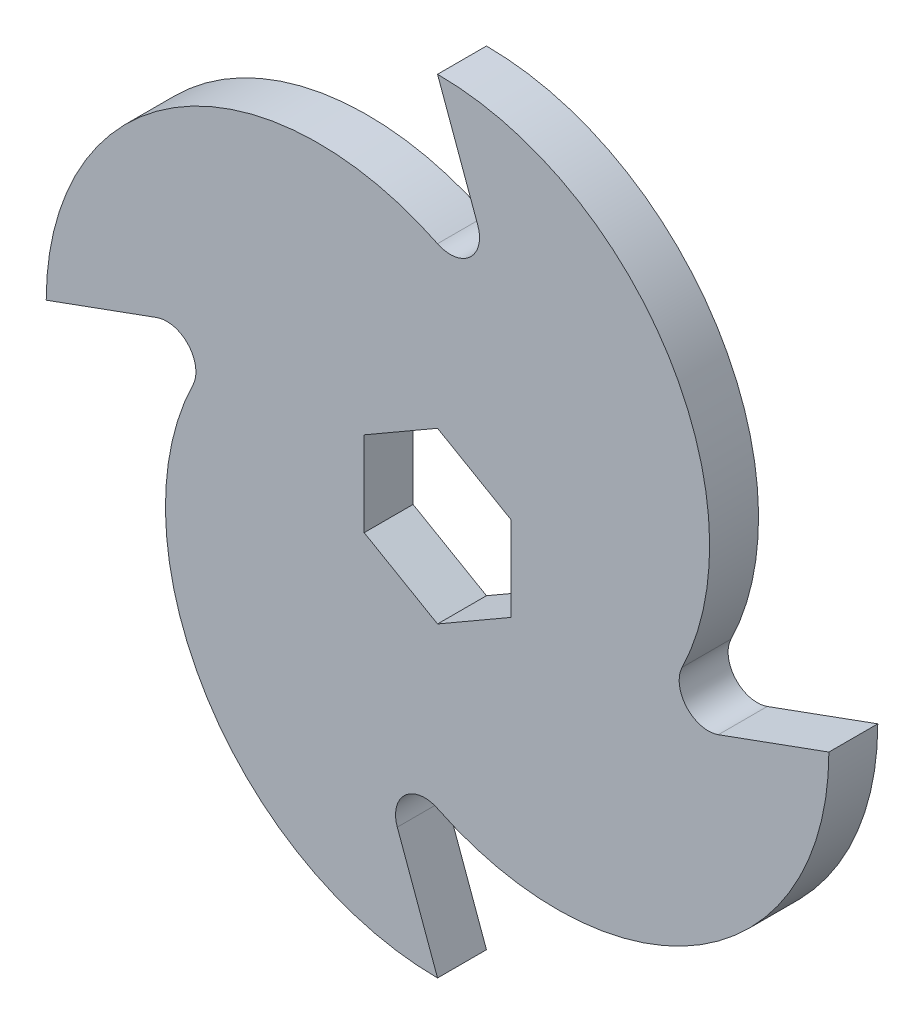
ISO-10303-21;
HEADER;
FILE_DESCRIPTION(('STEP AP214'),'2;1');
FILE_NAME('part.step','',(''),(''),'','','');
FILE_SCHEMA(('AUTOMOTIVE_DESIGN { 1 0 10303 214 1 1 1 1 }'));
ENDSEC;
DATA;
#1=APPLICATION_CONTEXT('core data for automotive mechanical design processes');
#2=APPLICATION_PROTOCOL_DEFINITION('international standard','automotive_design',2000,#1);
#3=PRODUCT_CONTEXT('',#1,'mechanical');
#4=PRODUCT('Part','Part','',(#3));
#5=PRODUCT_RELATED_PRODUCT_CATEGORY('part','',(#4));
#6=PRODUCT_DEFINITION_FORMATION('','',#4);
#7=PRODUCT_DEFINITION_CONTEXT('part definition',#1,'design');
#8=PRODUCT_DEFINITION('design','',#6,#7);
#9=PRODUCT_DEFINITION_SHAPE('','',#8);
#10=(LENGTH_UNIT() NAMED_UNIT(*) SI_UNIT(.MILLI.,.METRE.));
#11=(NAMED_UNIT(*) PLANE_ANGLE_UNIT() SI_UNIT($,.RADIAN.));
#12=(NAMED_UNIT(*) SI_UNIT($,.STERADIAN.) SOLID_ANGLE_UNIT());
#13=UNCERTAINTY_MEASURE_WITH_UNIT(LENGTH_MEASURE(1.E-05),#10,'distance_accuracy_value','');
#14=(GEOMETRIC_REPRESENTATION_CONTEXT(3) GLOBAL_UNCERTAINTY_ASSIGNED_CONTEXT((#13)) GLOBAL_UNIT_ASSIGNED_CONTEXT((#10,
#11,#12)) REPRESENTATION_CONTEXT('',''));
#15=CARTESIAN_POINT('',(0.,0.,0.));
#16=DIRECTION('',(0.,0.,1.));
#17=DIRECTION('',(1.,0.,0.));
#18=AXIS2_PLACEMENT_3D('',#15,#16,#17);
#19=CARTESIAN_POINT('',(4.76249999999999,8.24889197104678,3.175));
#20=DIRECTION('',(-0.5,-0.866025403784439,0.));
#21=DIRECTION('',(0.866025403784439,-0.5,0.));
#22=AXIS2_PLACEMENT_3D('',#19,#20,#21);
#23=PLANE('',#22);
#24=DIRECTION('',(-0.866025403784439,0.5,0.));
#25=VECTOR('',#24,1.);
#26=CARTESIAN_POINT('',(4.76249999999999,8.24889197104678,-3.175));
#27=LINE('',#26,#25);
#28=CARTESIAN_POINT('',(9.525,5.49926131403119,-3.175));
#29=VERTEX_POINT('',#28);
#30=CARTESIAN_POINT('',(0.,10.9985226280624,-3.175));
#31=VERTEX_POINT('',#30);
#32=EDGE_CURVE('E224',#29,#31,#27,.T.);
#33=ORIENTED_EDGE('',*,*,#32,.F.);
#34=DIRECTION('',(0.,0.,-1.));
#35=VECTOR('',#34,1.);
#36=CARTESIAN_POINT('',(9.525,5.49926131403119,3.175));
#37=LINE('',#36,#35);
#38=CARTESIAN_POINT('',(9.525,5.49926131403119,3.175));
#39=VERTEX_POINT('',#38);
#40=EDGE_CURVE('E11',#39,#29,#37,.T.);
#41=ORIENTED_EDGE('',*,*,#40,.F.);
#42=DIRECTION('',(-0.866025403784439,0.5,0.));
#43=VECTOR('',#42,1.);
#44=CARTESIAN_POINT('',(4.76249999999999,8.24889197104678,3.175));
#45=LINE('',#44,#43);
#46=CARTESIAN_POINT('',(0.,10.9985226280624,3.175));
#47=VERTEX_POINT('',#46);
#48=EDGE_CURVE('E319',#39,#47,#45,.T.);
#49=ORIENTED_EDGE('',*,*,#48,.T.);
#50=DIRECTION('',(0.,0.,-1.));
#51=VECTOR('',#50,1.);
#52=CARTESIAN_POINT('',(0.,10.9985226280624,3.175));
#53=LINE('',#52,#51);
#54=EDGE_CURVE('E56',#47,#31,#53,.T.);
#55=ORIENTED_EDGE('',*,*,#54,.T.);
#56=EDGE_LOOP('',(#33,#41,#49,#55));
#57=FACE_BOUND('',#56,.T.);
#58=ADVANCED_FACE('F37',(#57),#23,.T.);
#59=CARTESIAN_POINT('',(9.525,0.,3.175));
#60=DIRECTION('',(-1.,0.,0.));
#61=DIRECTION('',(0.,-1.,0.));
#62=AXIS2_PLACEMENT_3D('',#59,#60,#61);
#63=PLANE('',#62);
#64=DIRECTION('',(0.,1.,0.));
#65=VECTOR('',#64,1.);
#66=CARTESIAN_POINT('',(9.525,0.,-3.175));
#67=LINE('',#66,#65);
#68=CARTESIAN_POINT('',(9.525,-5.49926131403119,-3.175));
#69=VERTEX_POINT('',#68);
#70=EDGE_CURVE('E226',#69,#29,#67,.T.);
#71=ORIENTED_EDGE('',*,*,#70,.F.);
#72=DIRECTION('',(0.,0.,-1.));
#73=VECTOR('',#72,1.);
#74=CARTESIAN_POINT('',(9.525,-5.49926131403119,3.175));
#75=LINE('',#74,#73);
#76=CARTESIAN_POINT('',(9.525,-5.49926131403119,3.175));
#77=VERTEX_POINT('',#76);
#78=EDGE_CURVE('E47',#77,#69,#75,.T.);
#79=ORIENTED_EDGE('',*,*,#78,.F.);
#80=DIRECTION('',(0.,1.,0.));
#81=VECTOR('',#80,1.);
#82=CARTESIAN_POINT('',(9.525,0.,3.175));
#83=LINE('',#82,#81);
#84=EDGE_CURVE('E321',#77,#39,#83,.T.);
#85=ORIENTED_EDGE('',*,*,#84,.T.);
#86=ORIENTED_EDGE('',*,*,#40,.T.);
#87=EDGE_LOOP('',(#71,#79,#85,#86));
#88=FACE_BOUND('',#87,.T.);
#89=ADVANCED_FACE('F342',(#88),#63,.T.);
#90=CARTESIAN_POINT('',(4.7625,-8.24889197104678,3.175));
#91=DIRECTION('',(-0.5,0.866025403784439,0.));
#92=DIRECTION('',(-0.866025403784439,-0.5,0.));
#93=AXIS2_PLACEMENT_3D('',#90,#91,#92);
#94=PLANE('',#93);
#95=DIRECTION('',(0.866025403784439,0.5,0.));
#96=VECTOR('',#95,1.);
#97=CARTESIAN_POINT('',(4.7625,-8.24889197104678,-3.175));
#98=LINE('',#97,#96);
#99=CARTESIAN_POINT('',(0.,-10.9985226280624,-3.175));
#100=VERTEX_POINT('',#99);
#101=EDGE_CURVE('E229',#100,#69,#98,.T.);
#102=ORIENTED_EDGE('',*,*,#101,.F.);
#103=DIRECTION('',(0.,0.,-1.));
#104=VECTOR('',#103,1.);
#105=CARTESIAN_POINT('',(0.,-10.9985226280624,3.175));
#106=LINE('',#105,#104);
#107=CARTESIAN_POINT('',(0.,-10.9985226280624,3.175));
#108=VERTEX_POINT('',#107);
#109=EDGE_CURVE('E179',#108,#100,#106,.T.);
#110=ORIENTED_EDGE('',*,*,#109,.F.);
#111=DIRECTION('',(0.866025403784439,0.5,0.));
#112=VECTOR('',#111,1.);
#113=CARTESIAN_POINT('',(4.7625,-8.24889197104678,3.175));
#114=LINE('',#113,#112);
#115=EDGE_CURVE('E190',#108,#77,#114,.T.);
#116=ORIENTED_EDGE('',*,*,#115,.T.);
#117=ORIENTED_EDGE('',*,*,#78,.T.);
#118=EDGE_LOOP('',(#102,#110,#116,#117));
#119=FACE_BOUND('',#118,.T.);
#120=ADVANCED_FACE('F325',(#119),#94,.T.);
#121=CARTESIAN_POINT('',(-4.7625,-8.24889197104678,3.175));
#122=DIRECTION('',(0.5,0.866025403784439,0.));
#123=DIRECTION('',(-0.866025403784439,0.5,0.));
#124=AXIS2_PLACEMENT_3D('',#121,#122,#123);
#125=PLANE('',#124);
#126=DIRECTION('',(0.866025403784439,-0.5,0.));
#127=VECTOR('',#126,1.);
#128=CARTESIAN_POINT('',(-4.7625,-8.24889197104678,-3.175));
#129=LINE('',#128,#127);
#130=CARTESIAN_POINT('',(-9.525,-5.49926131403119,-3.175));
#131=VERTEX_POINT('',#130);
#132=EDGE_CURVE('E175',#131,#100,#129,.T.);
#133=ORIENTED_EDGE('',*,*,#132,.F.);
#134=DIRECTION('',(0.,0.,-1.));
#135=VECTOR('',#134,1.);
#136=CARTESIAN_POINT('',(-9.525,-5.49926131403119,3.175));
#137=LINE('',#136,#135);
#138=CARTESIAN_POINT('',(-9.525,-5.49926131403119,3.175));
#139=VERTEX_POINT('',#138);
#140=EDGE_CURVE('E170',#139,#131,#137,.T.);
#141=ORIENTED_EDGE('',*,*,#140,.F.);
#142=DIRECTION('',(0.866025403784439,-0.5,0.));
#143=VECTOR('',#142,1.);
#144=CARTESIAN_POINT('',(-4.7625,-8.24889197104678,3.175));
#145=LINE('',#144,#143);
#146=EDGE_CURVE('E173',#139,#108,#145,.T.);
#147=ORIENTED_EDGE('',*,*,#146,.T.);
#148=ORIENTED_EDGE('',*,*,#109,.T.);
#149=EDGE_LOOP('',(#133,#141,#147,#148));
#150=FACE_BOUND('',#149,.T.);
#151=ADVANCED_FACE('F172',(#150),#125,.T.);
#152=CARTESIAN_POINT('',(-9.525,0.,3.175));
#153=DIRECTION('',(1.,0.,0.));
#154=DIRECTION('',(0.,0.,-1.));
#155=AXIS2_PLACEMENT_3D('',#152,#153,#154);
#156=PLANE('',#155);
#157=DIRECTION('',(0.,-1.,0.));
#158=VECTOR('',#157,1.);
#159=CARTESIAN_POINT('',(-9.525,0.,-3.175));
#160=LINE('',#159,#158);
#161=CARTESIAN_POINT('',(-9.525,5.4992613140312,-3.175));
#162=VERTEX_POINT('',#161);
#163=EDGE_CURVE('E233',#162,#131,#160,.T.);
#164=ORIENTED_EDGE('',*,*,#163,.F.);
#165=DIRECTION('',(0.,0.,-1.));
#166=VECTOR('',#165,1.);
#167=CARTESIAN_POINT('',(-9.525,5.4992613140312,3.175));
#168=LINE('',#167,#166);
#169=CARTESIAN_POINT('',(-9.525,5.4992613140312,3.175));
#170=VERTEX_POINT('',#169);
#171=EDGE_CURVE('E111',#170,#162,#168,.T.);
#172=ORIENTED_EDGE('',*,*,#171,.F.);
#173=DIRECTION('',(0.,-1.,0.));
#174=VECTOR('',#173,1.);
#175=CARTESIAN_POINT('',(-9.525,0.,3.175));
#176=LINE('',#175,#174);
#177=EDGE_CURVE('E187',#170,#139,#176,.T.);
#178=ORIENTED_EDGE('',*,*,#177,.T.);
#179=ORIENTED_EDGE('',*,*,#140,.T.);
#180=EDGE_LOOP('',(#164,#172,#178,#179));
#181=FACE_BOUND('',#180,.T.);
#182=ADVANCED_FACE('F192',(#181),#156,.T.);
#183=CARTESIAN_POINT('',(-35.1565746055924,1.66070512022627,3.175));
#184=DIRECTION('',(0.,0.,-1.));
#185=DIRECTION('',(-1.,0.,0.));
#186=AXIS2_PLACEMENT_3D('',#183,#184,#185);
#187=CYLINDRICAL_SURFACE('',#186,3.78981424872157);
#188=CARTESIAN_POINT('',(-35.1565746055924,1.66070512022627,-3.175));
#189=DIRECTION('',(0.,0.,1.));
#190=DIRECTION('',(1.,0.,0.));
#191=AXIS2_PLACEMENT_3D('',#188,#189,#190);
#192=CIRCLE('',#191,3.78981424872157);
#193=CARTESIAN_POINT('',(-36.4527674181178,5.22196560389923,-3.175));
#194=VERTEX_POINT('',#193);
#195=CARTESIAN_POINT('',(-31.75,0.,-3.175));
#196=VERTEX_POINT('',#195);
#197=EDGE_CURVE('E199',#194,#196,#192,.F.);
#198=ORIENTED_EDGE('',*,*,#197,.T.);
#199=DIRECTION('',(0.,0.,-1.));
#200=VECTOR('',#199,1.);
#201=CARTESIAN_POINT('',(-31.75,0.,3.175));
#202=LINE('',#201,#200);
#203=CARTESIAN_POINT('',(-31.75,0.,3.175));
#204=VERTEX_POINT('',#203);
#205=EDGE_CURVE('E41',#204,#196,#202,.T.);
#206=ORIENTED_EDGE('',*,*,#205,.F.);
#207=CARTESIAN_POINT('',(-35.1565746055924,1.66070512022627,3.175));
#208=DIRECTION('',(0.,0.,1.));
#209=DIRECTION('',(1.,0.,0.));
#210=AXIS2_PLACEMENT_3D('',#207,#208,#209);
#211=CIRCLE('',#210,3.78981424872157);
#212=CARTESIAN_POINT('',(-36.4527674181178,5.22196560389923,3.175));
#213=VERTEX_POINT('',#212);
#214=EDGE_CURVE('E238',#213,#204,#211,.F.);
#215=ORIENTED_EDGE('',*,*,#214,.F.);
#216=DIRECTION('',(0.,0.,-1.));
#217=VECTOR('',#216,1.);
#218=CARTESIAN_POINT('',(-36.4527674181178,5.22196560389923,3.175));
#219=LINE('',#218,#217);
#220=EDGE_CURVE('E195',#213,#194,#219,.T.);
#221=ORIENTED_EDGE('',*,*,#220,.T.);
#222=EDGE_LOOP('',(#198,#206,#215,#221));
#223=FACE_BOUND('',#222,.T.);
#224=ADVANCED_FACE('F39',(#223),#187,.F.);
#225=CARTESIAN_POINT('',(0.,-15.478125,3.175));
#226=DIRECTION('',(0.,0.,-1.));
#227=DIRECTION('',(-1.,0.,0.));
#228=AXIS2_PLACEMENT_3D('',#225,#226,#227);
#229=CYLINDRICAL_SURFACE('',#228,35.321875);
#230=CARTESIAN_POINT('',(0.,-15.478125,-3.175));
#231=DIRECTION('',(0.,0.,1.));
#232=DIRECTION('',(1.,0.,0.));
#233=AXIS2_PLACEMENT_3D('',#230,#231,#232);
#234=CIRCLE('',#233,35.321875);
#235=CARTESIAN_POINT('',(-3.53883589099269E-13,-50.8,-3.175));
#236=VERTEX_POINT('',#235);
#237=EDGE_CURVE('E202',#196,#236,#234,.T.);
#238=ORIENTED_EDGE('',*,*,#237,.T.);
#239=DIRECTION('',(0.,0.,-1.));
#240=VECTOR('',#239,1.);
#241=CARTESIAN_POINT('',(-3.53883589099269E-13,-50.8,3.175));
#242=LINE('',#241,#240);
#243=CARTESIAN_POINT('',(-3.53883589099269E-13,-50.8,3.175));
#244=VERTEX_POINT('',#243);
#245=EDGE_CURVE('E271',#244,#236,#242,.T.);
#246=ORIENTED_EDGE('',*,*,#245,.F.);
#247=CARTESIAN_POINT('',(0.,-15.478125,3.175));
#248=DIRECTION('',(0.,0.,1.));
#249=DIRECTION('',(1.,0.,0.));
#250=AXIS2_PLACEMENT_3D('',#247,#248,#249);
#251=CIRCLE('',#250,35.321875);
#252=EDGE_CURVE('E124',#204,#244,#251,.T.);
#253=ORIENTED_EDGE('',*,*,#252,.F.);
#254=ORIENTED_EDGE('',*,*,#205,.T.);
#255=EDGE_LOOP('',(#238,#246,#253,#254));
#256=FACE_BOUND('',#255,.T.);
#257=ADVANCED_FACE('F277',(#256),#229,.T.);
#258=CARTESIAN_POINT('',(-16.3268052860373,-5.94247114477715,3.175));
#259=DIRECTION('',(-0.939692620785918,-0.342020143325642,0.));
#260=DIRECTION('',(0.342020143325642,-0.939692620785918,0.));
#261=AXIS2_PLACEMENT_3D('',#258,#259,#260);
#262=PLANE('',#261);
#263=DIRECTION('',(-0.342020143325642,0.939692620785918,0.));
#264=VECTOR('',#263,1.);
#265=CARTESIAN_POINT('',(-16.3268052860373,-5.94247114477715,-3.175));
#266=LINE('',#265,#264);
#267=CARTESIAN_POINT('',(-5.22196560389924,-36.4527674181178,-3.175));
#268=VERTEX_POINT('',#267);
#269=EDGE_CURVE('E204',#236,#268,#266,.T.);
#270=ORIENTED_EDGE('',*,*,#269,.T.);
#271=DIRECTION('',(0.,0.,-1.));
#272=VECTOR('',#271,1.);
#273=CARTESIAN_POINT('',(-5.22196560389924,-36.4527674181178,3.175));
#274=LINE('',#273,#272);
#275=CARTESIAN_POINT('',(-5.22196560389924,-36.4527674181178,3.175));
#276=VERTEX_POINT('',#275);
#277=EDGE_CURVE('E269',#276,#268,#274,.T.);
#278=ORIENTED_EDGE('',*,*,#277,.F.);
#279=DIRECTION('',(-0.342020143325642,0.939692620785918,0.));
#280=VECTOR('',#279,1.);
#281=CARTESIAN_POINT('',(-16.3268052860373,-5.94247114477715,3.175));
#282=LINE('',#281,#280);
#283=EDGE_CURVE('E299',#244,#276,#282,.T.);
#284=ORIENTED_EDGE('',*,*,#283,.F.);
#285=ORIENTED_EDGE('',*,*,#245,.T.);
#286=EDGE_LOOP('',(#270,#278,#284,#285));
#287=FACE_BOUND('',#286,.T.);
#288=ADVANCED_FACE('F290',(#287),#262,.F.);
#289=CARTESIAN_POINT('',(-1.66070512022628,-35.1565746055924,3.175));
#290=DIRECTION('',(0.,0.,-1.));
#291=DIRECTION('',(-1.,0.,0.));
#292=AXIS2_PLACEMENT_3D('',#289,#290,#291);
#293=CYLINDRICAL_SURFACE('',#292,3.78981424872156);
#294=CARTESIAN_POINT('',(-1.66070512022628,-35.1565746055924,-3.175));
#295=DIRECTION('',(0.,0.,1.));
#296=DIRECTION('',(1.,0.,0.));
#297=AXIS2_PLACEMENT_3D('',#294,#295,#296);
#298=CIRCLE('',#297,3.78981424872156);
#299=CARTESIAN_POINT('',(0.,-31.75,-3.175));
#300=VERTEX_POINT('',#299);
#301=EDGE_CURVE('E206',#268,#300,#298,.F.);
#302=ORIENTED_EDGE('',*,*,#301,.T.);
#303=DIRECTION('',(0.,0.,-1.));
#304=VECTOR('',#303,1.);
#305=CARTESIAN_POINT('',(0.,-31.75,3.175));
#306=LINE('',#305,#304);
#307=CARTESIAN_POINT('',(0.,-31.75,3.175));
#308=VERTEX_POINT('',#307);
#309=EDGE_CURVE('E266',#308,#300,#306,.T.);
#310=ORIENTED_EDGE('',*,*,#309,.F.);
#311=CARTESIAN_POINT('',(-1.66070512022628,-35.1565746055924,3.175));
#312=DIRECTION('',(0.,0.,1.));
#313=DIRECTION('',(1.,0.,0.));
#314=AXIS2_PLACEMENT_3D('',#311,#312,#313);
#315=CIRCLE('',#314,3.78981424872156);
#316=EDGE_CURVE('E295',#276,#308,#315,.F.);
#317=ORIENTED_EDGE('',*,*,#316,.F.);
#318=ORIENTED_EDGE('',*,*,#277,.T.);
#319=EDGE_LOOP('',(#302,#310,#317,#318));
#320=FACE_BOUND('',#319,.T.);
#321=ADVANCED_FACE('F293',(#320),#293,.F.);
#322=CARTESIAN_POINT('',(15.478125,0.,3.175));
#323=DIRECTION('',(0.,0.,-1.));
#324=DIRECTION('',(-1.,0.,0.));
#325=AXIS2_PLACEMENT_3D('',#322,#323,#324);
#326=CYLINDRICAL_SURFACE('',#325,35.321875);
#327=CARTESIAN_POINT('',(15.478125,0.,-3.175));
#328=DIRECTION('',(0.,0.,1.));
#329=DIRECTION('',(1.,0.,0.));
#330=AXIS2_PLACEMENT_3D('',#327,#328,#329);
#331=CIRCLE('',#330,35.321875);
#332=CARTESIAN_POINT('',(50.8,-1.76941794549634E-13,-3.175));
#333=VERTEX_POINT('',#332);
#334=EDGE_CURVE('E208',#300,#333,#331,.T.);
#335=ORIENTED_EDGE('',*,*,#334,.T.);
#336=DIRECTION('',(0.,0.,-1.));
#337=VECTOR('',#336,1.);
#338=CARTESIAN_POINT('',(50.8,-1.76941794549634E-13,3.175));
#339=LINE('',#338,#337);
#340=CARTESIAN_POINT('',(50.8,-1.76941794549634E-13,3.175));
#341=VERTEX_POINT('',#340);
#342=EDGE_CURVE('E263',#341,#333,#339,.T.);
#343=ORIENTED_EDGE('',*,*,#342,.F.);
#344=CARTESIAN_POINT('',(15.478125,0.,3.175));
#345=DIRECTION('',(0.,0.,1.));
#346=DIRECTION('',(1.,0.,0.));
#347=AXIS2_PLACEMENT_3D('',#344,#345,#346);
#348=CIRCLE('',#347,35.321875);
#349=EDGE_CURVE('E298',#308,#341,#348,.T.);
#350=ORIENTED_EDGE('',*,*,#349,.F.);
#351=ORIENTED_EDGE('',*,*,#309,.T.);
#352=EDGE_LOOP('',(#335,#343,#350,#351));
#353=FACE_BOUND('',#352,.T.);
#354=ADVANCED_FACE('F373',(#353),#326,.T.);
#355=CARTESIAN_POINT('',(5.94247114477748,-16.3268052860376,3.175));
#356=DIRECTION('',(0.342020143325653,-0.939692620785914,0.));
#357=DIRECTION('',(0.939692620785914,0.342020143325653,0.));
#358=AXIS2_PLACEMENT_3D('',#355,#356,#357);
#359=PLANE('',#358);
#360=DIRECTION('',(-0.939692620785914,-0.342020143325653,0.));
#361=VECTOR('',#360,1.);
#362=CARTESIAN_POINT('',(5.94247114477748,-16.3268052860376,-3.175));
#363=LINE('',#362,#361);
#364=CARTESIAN_POINT('',(36.4527674181178,-5.22196560389926,-3.175));
#365=VERTEX_POINT('',#364);
#366=EDGE_CURVE('E210',#333,#365,#363,.T.);
#367=ORIENTED_EDGE('',*,*,#366,.T.);
#368=DIRECTION('',(0.,0.,-1.));
#369=VECTOR('',#368,1.);
#370=CARTESIAN_POINT('',(36.4527674181178,-5.22196560389926,3.175));
#371=LINE('',#370,#369);
#372=CARTESIAN_POINT('',(36.4527674181178,-5.22196560389926,3.175));
#373=VERTEX_POINT('',#372);
#374=EDGE_CURVE('E260',#373,#365,#371,.T.);
#375=ORIENTED_EDGE('',*,*,#374,.F.);
#376=DIRECTION('',(-0.939692620785914,-0.342020143325653,0.));
#377=VECTOR('',#376,1.);
#378=CARTESIAN_POINT('',(5.94247114477748,-16.3268052860376,3.175));
#379=LINE('',#378,#377);
#380=EDGE_CURVE('E301',#341,#373,#379,.T.);
#381=ORIENTED_EDGE('',*,*,#380,.F.);
#382=ORIENTED_EDGE('',*,*,#342,.T.);
#383=EDGE_LOOP('',(#367,#375,#381,#382));
#384=FACE_BOUND('',#383,.T.);
#385=ADVANCED_FACE('F369',(#384),#359,.F.);
#386=CARTESIAN_POINT('',(35.1565746055924,-1.6607051202263,3.175));
#387=DIRECTION('',(0.,0.,-1.));
#388=DIRECTION('',(-1.,0.,0.));
#389=AXIS2_PLACEMENT_3D('',#386,#387,#388);
#390=CYLINDRICAL_SURFACE('',#389,3.78981424872156);
#391=CARTESIAN_POINT('',(35.1565746055924,-1.6607051202263,-3.175));
#392=DIRECTION('',(0.,0.,1.));
#393=DIRECTION('',(1.,0.,0.));
#394=AXIS2_PLACEMENT_3D('',#391,#392,#393);
#395=CIRCLE('',#394,3.78981424872156);
#396=CARTESIAN_POINT('',(31.75,0.,-3.175));
#397=VERTEX_POINT('',#396);
#398=EDGE_CURVE('E212',#365,#397,#395,.F.);
#399=ORIENTED_EDGE('',*,*,#398,.T.);
#400=DIRECTION('',(0.,0.,-1.));
#401=VECTOR('',#400,1.);
#402=CARTESIAN_POINT('',(31.75,0.,3.175));
#403=LINE('',#402,#401);
#404=CARTESIAN_POINT('',(31.75,0.,3.175));
#405=VERTEX_POINT('',#404);
#406=EDGE_CURVE('E257',#405,#397,#403,.T.);
#407=ORIENTED_EDGE('',*,*,#406,.F.);
#408=CARTESIAN_POINT('',(35.1565746055924,-1.6607051202263,3.175));
#409=DIRECTION('',(0.,0.,1.));
#410=DIRECTION('',(1.,0.,0.));
#411=AXIS2_PLACEMENT_3D('',#408,#409,#410);
#412=CIRCLE('',#411,3.78981424872156);
#413=EDGE_CURVE('E307',#373,#405,#412,.F.);
#414=ORIENTED_EDGE('',*,*,#413,.F.);
#415=ORIENTED_EDGE('',*,*,#374,.T.);
#416=EDGE_LOOP('',(#399,#407,#414,#415));
#417=FACE_BOUND('',#416,.T.);
#418=ADVANCED_FACE('F365',(#417),#390,.F.);
#419=CARTESIAN_POINT('',(0.,15.478125,3.175));
#420=DIRECTION('',(0.,0.,-1.));
#421=DIRECTION('',(-1.,0.,0.));
#422=AXIS2_PLACEMENT_3D('',#419,#420,#421);
#423=CYLINDRICAL_SURFACE('',#422,35.321875);
#424=CARTESIAN_POINT('',(0.,15.478125,-3.175));
#425=DIRECTION('',(0.,0.,1.));
#426=DIRECTION('',(1.,0.,0.));
#427=AXIS2_PLACEMENT_3D('',#424,#425,#426);
#428=CIRCLE('',#427,35.321875);
#429=CARTESIAN_POINT('',(0.,50.8,-3.175));
#430=VERTEX_POINT('',#429);
#431=EDGE_CURVE('E214',#397,#430,#428,.T.);
#432=ORIENTED_EDGE('',*,*,#431,.T.);
#433=DIRECTION('',(0.,0.,-1.));
#434=VECTOR('',#433,1.);
#435=CARTESIAN_POINT('',(0.,50.8,3.175));
#436=LINE('',#435,#434);
#437=CARTESIAN_POINT('',(0.,50.8,3.175));
#438=VERTEX_POINT('',#437);
#439=EDGE_CURVE('E254',#438,#430,#436,.T.);
#440=ORIENTED_EDGE('',*,*,#439,.F.);
#441=CARTESIAN_POINT('',(0.,15.478125,3.175));
#442=DIRECTION('',(0.,0.,1.));
#443=DIRECTION('',(1.,0.,0.));
#444=AXIS2_PLACEMENT_3D('',#441,#442,#443);
#445=CIRCLE('',#444,35.321875);
#446=EDGE_CURVE('E309',#405,#438,#445,.T.);
#447=ORIENTED_EDGE('',*,*,#446,.F.);
#448=ORIENTED_EDGE('',*,*,#406,.T.);
#449=EDGE_LOOP('',(#432,#440,#447,#448));
#450=FACE_BOUND('',#449,.T.);
#451=ADVANCED_FACE('F361',(#450),#423,.T.);
#452=CARTESIAN_POINT('',(16.3268052860379,5.94247114477775,3.175));
#453=DIRECTION('',(0.93969262078591,0.342020143325663,0.));
#454=DIRECTION('',(-0.342020143325663,0.939692620785911,0.));
#455=AXIS2_PLACEMENT_3D('',#452,#453,#454);
#456=PLANE('',#455);
#457=DIRECTION('',(0.342020143325663,-0.939692620785911,0.));
#458=VECTOR('',#457,1.);
#459=CARTESIAN_POINT('',(16.3268052860379,5.94247114477775,-3.175));
#460=LINE('',#459,#458);
#461=CARTESIAN_POINT('',(5.22196560389925,36.4527674181178,-3.175));
#462=VERTEX_POINT('',#461);
#463=EDGE_CURVE('E216',#430,#462,#460,.T.);
#464=ORIENTED_EDGE('',*,*,#463,.T.);
#465=DIRECTION('',(0.,0.,-1.));
#466=VECTOR('',#465,1.);
#467=CARTESIAN_POINT('',(5.22196560389925,36.4527674181178,3.175));
#468=LINE('',#467,#466);
#469=CARTESIAN_POINT('',(5.22196560389925,36.4527674181178,3.175));
#470=VERTEX_POINT('',#469);
#471=EDGE_CURVE('E251',#470,#462,#468,.T.);
#472=ORIENTED_EDGE('',*,*,#471,.F.);
#473=DIRECTION('',(0.342020143325663,-0.939692620785911,0.));
#474=VECTOR('',#473,1.);
#475=CARTESIAN_POINT('',(16.3268052860379,5.94247114477775,3.175));
#476=LINE('',#475,#474);
#477=EDGE_CURVE('E311',#438,#470,#476,.T.);
#478=ORIENTED_EDGE('',*,*,#477,.F.);
#479=ORIENTED_EDGE('',*,*,#439,.T.);
#480=EDGE_LOOP('',(#464,#472,#478,#479));
#481=FACE_BOUND('',#480,.T.);
#482=ADVANCED_FACE('F357',(#481),#456,.F.);
#483=CARTESIAN_POINT('',(1.66070512022629,35.1565746055924,3.175));
#484=DIRECTION('',(0.,0.,-1.));
#485=DIRECTION('',(-1.,0.,0.));
#486=AXIS2_PLACEMENT_3D('',#483,#484,#485);
#487=CYLINDRICAL_SURFACE('',#486,3.78981424872156);
#488=CARTESIAN_POINT('',(1.66070512022629,35.1565746055924,-3.175));
#489=DIRECTION('',(0.,0.,1.));
#490=DIRECTION('',(1.,0.,0.));
#491=AXIS2_PLACEMENT_3D('',#488,#489,#490);
#492=CIRCLE('',#491,3.78981424872156);
#493=CARTESIAN_POINT('',(0.,31.75,-3.175));
#494=VERTEX_POINT('',#493);
#495=EDGE_CURVE('E218',#462,#494,#492,.F.);
#496=ORIENTED_EDGE('',*,*,#495,.T.);
#497=DIRECTION('',(0.,0.,-1.));
#498=VECTOR('',#497,1.);
#499=CARTESIAN_POINT('',(0.,31.75,3.175));
#500=LINE('',#499,#498);
#501=CARTESIAN_POINT('',(0.,31.75,3.175));
#502=VERTEX_POINT('',#501);
#503=EDGE_CURVE('E248',#502,#494,#500,.T.);
#504=ORIENTED_EDGE('',*,*,#503,.F.);
#505=CARTESIAN_POINT('',(1.66070512022629,35.1565746055924,3.175));
#506=DIRECTION('',(0.,0.,1.));
#507=DIRECTION('',(1.,0.,0.));
#508=AXIS2_PLACEMENT_3D('',#505,#506,#507);
#509=CIRCLE('',#508,3.78981424872156);
#510=EDGE_CURVE('E313',#470,#502,#509,.F.);
#511=ORIENTED_EDGE('',*,*,#510,.F.);
#512=ORIENTED_EDGE('',*,*,#471,.T.);
#513=EDGE_LOOP('',(#496,#504,#511,#512));
#514=FACE_BOUND('',#513,.T.);
#515=ADVANCED_FACE('F353',(#514),#487,.F.);
#516=CARTESIAN_POINT('',(-15.478125,0.,3.175));
#517=DIRECTION('',(0.,0.,-1.));
#518=DIRECTION('',(-1.,0.,0.));
#519=AXIS2_PLACEMENT_3D('',#516,#517,#518);
#520=CYLINDRICAL_SURFACE('',#519,35.321875);
#521=CARTESIAN_POINT('',(-15.478125,0.,-3.175));
#522=DIRECTION('',(0.,0.,1.));
#523=DIRECTION('',(1.,0.,0.));
#524=AXIS2_PLACEMENT_3D('',#521,#522,#523);
#525=CIRCLE('',#524,35.321875);
#526=CARTESIAN_POINT('',(-50.8,5.30825383648903E-13,-3.175));
#527=VERTEX_POINT('',#526);
#528=EDGE_CURVE('E220',#494,#527,#525,.T.);
#529=ORIENTED_EDGE('',*,*,#528,.T.);
#530=DIRECTION('',(0.,0.,-1.));
#531=VECTOR('',#530,1.);
#532=CARTESIAN_POINT('',(-50.8,5.30825383648903E-13,3.175));
#533=LINE('',#532,#531);
#534=CARTESIAN_POINT('',(-50.8,5.30825383648903E-13,3.175));
#535=VERTEX_POINT('',#534);
#536=EDGE_CURVE('E245',#535,#527,#533,.T.);
#537=ORIENTED_EDGE('',*,*,#536,.F.);
#538=CARTESIAN_POINT('',(-15.478125,0.,3.175));
#539=DIRECTION('',(0.,0.,1.));
#540=DIRECTION('',(1.,0.,0.));
#541=AXIS2_PLACEMENT_3D('',#538,#539,#540);
#542=CIRCLE('',#541,35.321875);
#543=EDGE_CURVE('E315',#502,#535,#542,.T.);
#544=ORIENTED_EDGE('',*,*,#543,.F.);
#545=ORIENTED_EDGE('',*,*,#503,.T.);
#546=EDGE_LOOP('',(#529,#537,#544,#545));
#547=FACE_BOUND('',#546,.T.);
#548=ADVANCED_FACE('F336',(#547),#520,.T.);
#549=CARTESIAN_POINT('',(-5.94247114477681,16.326805286037,3.175));
#550=DIRECTION('',(-0.342020143325631,0.939692620785922,0.));
#551=DIRECTION('',(-0.939692620785922,-0.342020143325631,0.));
#552=AXIS2_PLACEMENT_3D('',#549,#550,#551);
#553=PLANE('',#552);
#554=DIRECTION('',(0.939692620785922,0.342020143325631,0.));
#555=VECTOR('',#554,1.);
#556=CARTESIAN_POINT('',(-5.94247114477681,16.326805286037,-3.175));
#557=LINE('',#556,#555);
#558=EDGE_CURVE('E222',#527,#194,#557,.T.);
#559=ORIENTED_EDGE('',*,*,#558,.T.);
#560=ORIENTED_EDGE('',*,*,#220,.F.);
#561=DIRECTION('',(0.939692620785922,0.342020143325631,0.));
#562=VECTOR('',#561,1.);
#563=CARTESIAN_POINT('',(-5.94247114477681,16.326805286037,3.175));
#564=LINE('',#563,#562);
#565=EDGE_CURVE('E317',#535,#213,#564,.T.);
#566=ORIENTED_EDGE('',*,*,#565,.F.);
#567=ORIENTED_EDGE('',*,*,#536,.T.);
#568=EDGE_LOOP('',(#559,#560,#566,#567));
#569=FACE_BOUND('',#568,.T.);
#570=ADVANCED_FACE('F329',(#569),#553,.F.);
#571=CARTESIAN_POINT('',(-4.7625,8.24889197104679,3.175));
#572=DIRECTION('',(0.5,-0.866025403784439,0.));
#573=DIRECTION('',(0.866025403784439,0.5,0.));
#574=AXIS2_PLACEMENT_3D('',#571,#572,#573);
#575=PLANE('',#574);
#576=DIRECTION('',(-0.866025403784439,-0.5,0.));
#577=VECTOR('',#576,1.);
#578=CARTESIAN_POINT('',(-4.7625,8.24889197104679,-3.175));
#579=LINE('',#578,#577);
#580=EDGE_CURVE('E235',#31,#162,#579,.T.);
#581=ORIENTED_EDGE('',*,*,#580,.F.);
#582=ORIENTED_EDGE('',*,*,#54,.F.);
#583=DIRECTION('',(-0.866025403784439,-0.5,0.));
#584=VECTOR('',#583,1.);
#585=CARTESIAN_POINT('',(-4.7625,8.24889197104679,3.175));
#586=LINE('',#585,#584);
#587=EDGE_CURVE('E193',#47,#170,#586,.T.);
#588=ORIENTED_EDGE('',*,*,#587,.T.);
#589=ORIENTED_EDGE('',*,*,#171,.T.);
#590=EDGE_LOOP('',(#581,#582,#588,#589));
#591=FACE_BOUND('',#590,.T.);
#592=ADVANCED_FACE('F327',(#591),#575,.T.);
#593=CARTESIAN_POINT('',(0.,0.,3.175));
#594=DIRECTION('',(0.,0.,1.));
#595=DIRECTION('',(1.,0.,0.));
#596=AXIS2_PLACEMENT_3D('',#593,#594,#595);
#597=PLANE('',#596);
#598=ORIENTED_EDGE('',*,*,#214,.T.);
#599=ORIENTED_EDGE('',*,*,#252,.T.);
#600=ORIENTED_EDGE('',*,*,#283,.T.);
#601=ORIENTED_EDGE('',*,*,#316,.T.);
#602=ORIENTED_EDGE('',*,*,#349,.T.);
#603=ORIENTED_EDGE('',*,*,#380,.T.);
#604=ORIENTED_EDGE('',*,*,#413,.T.);
#605=ORIENTED_EDGE('',*,*,#446,.T.);
#606=ORIENTED_EDGE('',*,*,#477,.T.);
#607=ORIENTED_EDGE('',*,*,#510,.T.);
#608=ORIENTED_EDGE('',*,*,#543,.T.);
#609=ORIENTED_EDGE('',*,*,#565,.T.);
#610=EDGE_LOOP('',(#598,#599,#600,#601,#602,#603,#604,#605,#606,#607,#608,#609));
#611=FACE_BOUND('',#610,.T.);
#612=ORIENTED_EDGE('',*,*,#48,.F.);
#613=ORIENTED_EDGE('',*,*,#84,.F.);
#614=ORIENTED_EDGE('',*,*,#115,.F.);
#615=ORIENTED_EDGE('',*,*,#146,.F.);
#616=ORIENTED_EDGE('',*,*,#177,.F.);
#617=ORIENTED_EDGE('',*,*,#587,.F.);
#618=EDGE_LOOP('',(#612,#613,#614,#615,#616,#617));
#619=FACE_BOUND('',#618,.T.);
#620=ADVANCED_FACE('F185',(#611,#619),#597,.T.);
#621=CARTESIAN_POINT('',(0.,0.,-3.175));
#622=DIRECTION('',(0.,0.,1.));
#623=DIRECTION('',(1.,0.,0.));
#624=AXIS2_PLACEMENT_3D('',#621,#622,#623);
#625=PLANE('',#624);
#626=ORIENTED_EDGE('',*,*,#197,.F.);
#627=ORIENTED_EDGE('',*,*,#558,.F.);
#628=ORIENTED_EDGE('',*,*,#528,.F.);
#629=ORIENTED_EDGE('',*,*,#495,.F.);
#630=ORIENTED_EDGE('',*,*,#463,.F.);
#631=ORIENTED_EDGE('',*,*,#431,.F.);
#632=ORIENTED_EDGE('',*,*,#398,.F.);
#633=ORIENTED_EDGE('',*,*,#366,.F.);
#634=ORIENTED_EDGE('',*,*,#334,.F.);
#635=ORIENTED_EDGE('',*,*,#301,.F.);
#636=ORIENTED_EDGE('',*,*,#269,.F.);
#637=ORIENTED_EDGE('',*,*,#237,.F.);
#638=EDGE_LOOP('',(#626,#627,#628,#629,#630,#631,#632,#633,#634,#635,#636,#637));
#639=FACE_BOUND('',#638,.T.);
#640=ORIENTED_EDGE('',*,*,#32,.T.);
#641=ORIENTED_EDGE('',*,*,#580,.T.);
#642=ORIENTED_EDGE('',*,*,#163,.T.);
#643=ORIENTED_EDGE('',*,*,#132,.T.);
#644=ORIENTED_EDGE('',*,*,#101,.T.);
#645=ORIENTED_EDGE('',*,*,#70,.T.);
#646=EDGE_LOOP('',(#640,#641,#642,#643,#644,#645));
#647=FACE_BOUND('',#646,.T.);
#648=ADVANCED_FACE('F284',(#639,#647),#625,.F.);
#649=CLOSED_SHELL('',(#58,#89,#120,#151,#182,#224,#257,#288,#321,#354,#385,#418,#451,#482,#515,
#548,#570,#592,#620,#648));
#650=MANIFOLD_SOLID_BREP('B2',#649);
#651=ADVANCED_BREP_SHAPE_REPRESENTATION('',(#18,#650),#14);
#652=SHAPE_DEFINITION_REPRESENTATION(#9,#651);
ENDSEC;
END-ISO-10303-21;
